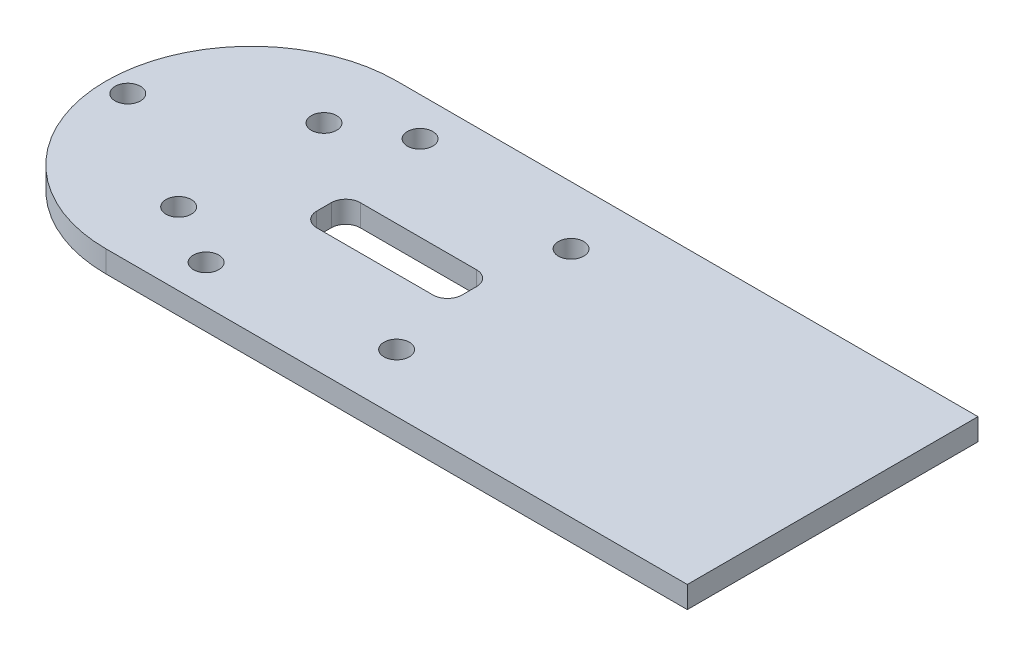
ISO-10303-21;
HEADER;
FILE_DESCRIPTION(('STEP AP214'),'2;1');
FILE_NAME('part.step','',(''),(''),'','','');
FILE_SCHEMA(('AUTOMOTIVE_DESIGN { 1 0 10303 214 1 1 1 1 }'));
ENDSEC;
DATA;
#1=APPLICATION_CONTEXT('core data for automotive mechanical design processes');
#2=APPLICATION_PROTOCOL_DEFINITION('international standard','automotive_design',2000,#1);
#3=PRODUCT_CONTEXT('',#1,'mechanical');
#4=PRODUCT('Part','Part','',(#3));
#5=PRODUCT_RELATED_PRODUCT_CATEGORY('part','',(#4));
#6=PRODUCT_DEFINITION_FORMATION('','',#4);
#7=PRODUCT_DEFINITION_CONTEXT('part definition',#1,'design');
#8=PRODUCT_DEFINITION('design','',#6,#7);
#9=PRODUCT_DEFINITION_SHAPE('','',#8);
#10=(LENGTH_UNIT() NAMED_UNIT(*) SI_UNIT(.MILLI.,.METRE.));
#11=(NAMED_UNIT(*) PLANE_ANGLE_UNIT() SI_UNIT($,.RADIAN.));
#12=(NAMED_UNIT(*) SI_UNIT($,.STERADIAN.) SOLID_ANGLE_UNIT());
#13=UNCERTAINTY_MEASURE_WITH_UNIT(LENGTH_MEASURE(1.E-05),#10,'distance_accuracy_value','');
#14=(GEOMETRIC_REPRESENTATION_CONTEXT(3) GLOBAL_UNCERTAINTY_ASSIGNED_CONTEXT((#13)) GLOBAL_UNIT_ASSIGNED_CONTEXT((#10,
#11,#12)) REPRESENTATION_CONTEXT('',''));
#15=CARTESIAN_POINT('',(0.,0.,0.));
#16=DIRECTION('',(0.,0.,1.));
#17=DIRECTION('',(1.,0.,0.));
#18=AXIS2_PLACEMENT_3D('',#15,#16,#17);
#19=CARTESIAN_POINT('',(50.,3.,20.));
#20=DIRECTION('',(-1.,0.,0.));
#21=DIRECTION('',(0.,0.,1.));
#22=AXIS2_PLACEMENT_3D('',#19,#20,#21);
#23=PLANE('',#22);
#24=DIRECTION('',(0.,0.,-1.));
#25=VECTOR('',#24,1.);
#26=CARTESIAN_POINT('',(50.,0.,20.));
#27=LINE('',#26,#25);
#28=CARTESIAN_POINT('',(50.,0.,20.));
#29=VERTEX_POINT('',#28);
#30=CARTESIAN_POINT('',(50.,0.,-20.));
#31=VERTEX_POINT('',#30);
#32=EDGE_CURVE('E146',#29,#31,#27,.T.);
#33=ORIENTED_EDGE('',*,*,#32,.T.);
#34=DIRECTION('',(0.,-1.,0.));
#35=VECTOR('',#34,1.);
#36=CARTESIAN_POINT('',(50.,3.,-20.));
#37=LINE('',#36,#35);
#38=CARTESIAN_POINT('',(50.,3.,-20.));
#39=VERTEX_POINT('',#38);
#40=EDGE_CURVE('E127',#39,#31,#37,.T.);
#41=ORIENTED_EDGE('',*,*,#40,.F.);
#42=DIRECTION('',(0.,0.,-1.));
#43=VECTOR('',#42,1.);
#44=CARTESIAN_POINT('',(50.,3.,20.));
#45=LINE('',#44,#43);
#46=CARTESIAN_POINT('',(50.,3.,20.));
#47=VERTEX_POINT('',#46);
#48=EDGE_CURVE('E134',#47,#39,#45,.T.);
#49=ORIENTED_EDGE('',*,*,#48,.F.);
#50=DIRECTION('',(0.,-1.,0.));
#51=VECTOR('',#50,1.);
#52=CARTESIAN_POINT('',(50.,3.,20.));
#53=LINE('',#52,#51);
#54=EDGE_CURVE('E236',#47,#29,#53,.T.);
#55=ORIENTED_EDGE('',*,*,#54,.T.);
#56=EDGE_LOOP('',(#33,#41,#49,#55));
#57=FACE_BOUND('',#56,.T.);
#58=ADVANCED_FACE('F33',(#57),#23,.F.);
#59=CARTESIAN_POINT('',(50.,3.,-20.));
#60=DIRECTION('',(0.,0.,1.));
#61=DIRECTION('',(1.,0.,0.));
#62=AXIS2_PLACEMENT_3D('',#59,#60,#61);
#63=PLANE('',#62);
#64=DIRECTION('',(-1.,0.,0.));
#65=VECTOR('',#64,1.);
#66=CARTESIAN_POINT('',(50.,0.,-20.));
#67=LINE('',#66,#65);
#68=CARTESIAN_POINT('',(-30.,0.,-20.));
#69=VERTEX_POINT('',#68);
#70=EDGE_CURVE('E238',#31,#69,#67,.T.);
#71=ORIENTED_EDGE('',*,*,#70,.T.);
#72=DIRECTION('',(0.,-1.,0.));
#73=VECTOR('',#72,1.);
#74=CARTESIAN_POINT('',(-30.,3.,-20.));
#75=LINE('',#74,#73);
#76=CARTESIAN_POINT('',(-30.,3.,-20.));
#77=VERTEX_POINT('',#76);
#78=EDGE_CURVE('E130',#77,#69,#75,.T.);
#79=ORIENTED_EDGE('',*,*,#78,.F.);
#80=DIRECTION('',(-1.,0.,0.));
#81=VECTOR('',#80,1.);
#82=CARTESIAN_POINT('',(50.,3.,-20.));
#83=LINE('',#82,#81);
#84=EDGE_CURVE('E123',#39,#77,#83,.T.);
#85=ORIENTED_EDGE('',*,*,#84,.F.);
#86=ORIENTED_EDGE('',*,*,#40,.T.);
#87=EDGE_LOOP('',(#71,#79,#85,#86));
#88=FACE_BOUND('',#87,.T.);
#89=ADVANCED_FACE('F125',(#88),#63,.F.);
#90=CARTESIAN_POINT('',(-30.,3.,0.));
#91=DIRECTION('',(0.,-1.,0.));
#92=DIRECTION('',(0.,0.,-1.));
#93=AXIS2_PLACEMENT_3D('',#90,#91,#92);
#94=CYLINDRICAL_SURFACE('',#93,20.);
#95=CARTESIAN_POINT('',(-30.,0.,0.));
#96=DIRECTION('',(0.,1.,0.));
#97=DIRECTION('',(0.,0.,1.));
#98=AXIS2_PLACEMENT_3D('',#95,#96,#97);
#99=CIRCLE('',#98,20.);
#100=CARTESIAN_POINT('',(-30.,0.,20.));
#101=VERTEX_POINT('',#100);
#102=EDGE_CURVE('E240',#69,#101,#99,.T.);
#103=ORIENTED_EDGE('',*,*,#102,.T.);
#104=DIRECTION('',(0.,-1.,0.));
#105=VECTOR('',#104,1.);
#106=CARTESIAN_POINT('',(-30.,3.,20.));
#107=LINE('',#106,#105);
#108=CARTESIAN_POINT('',(-30.,3.,20.));
#109=VERTEX_POINT('',#108);
#110=EDGE_CURVE('E151',#109,#101,#107,.T.);
#111=ORIENTED_EDGE('',*,*,#110,.F.);
#112=CARTESIAN_POINT('',(-30.,3.,0.));
#113=DIRECTION('',(0.,1.,0.));
#114=DIRECTION('',(0.,0.,1.));
#115=AXIS2_PLACEMENT_3D('',#112,#113,#114);
#116=CIRCLE('',#115,20.);
#117=EDGE_CURVE('E133',#77,#109,#116,.T.);
#118=ORIENTED_EDGE('',*,*,#117,.F.);
#119=ORIENTED_EDGE('',*,*,#78,.T.);
#120=EDGE_LOOP('',(#103,#111,#118,#119));
#121=FACE_BOUND('',#120,.T.);
#122=ADVANCED_FACE('F251',(#121),#94,.T.);
#123=CARTESIAN_POINT('',(50.,3.,20.));
#124=DIRECTION('',(0.,0.,-1.));
#125=DIRECTION('',(-1.,0.,0.));
#126=AXIS2_PLACEMENT_3D('',#123,#124,#125);
#127=PLANE('',#126);
#128=DIRECTION('',(1.,0.,0.));
#129=VECTOR('',#128,1.);
#130=CARTESIAN_POINT('',(50.,0.,20.));
#131=LINE('',#130,#129);
#132=EDGE_CURVE('E143',#101,#29,#131,.T.);
#133=ORIENTED_EDGE('',*,*,#132,.T.);
#134=ORIENTED_EDGE('',*,*,#54,.F.);
#135=DIRECTION('',(1.,0.,0.));
#136=VECTOR('',#135,1.);
#137=CARTESIAN_POINT('',(50.,3.,20.));
#138=LINE('',#137,#136);
#139=EDGE_CURVE('E139',#109,#47,#138,.T.);
#140=ORIENTED_EDGE('',*,*,#139,.F.);
#141=ORIENTED_EDGE('',*,*,#110,.T.);
#142=EDGE_LOOP('',(#133,#134,#140,#141));
#143=FACE_BOUND('',#142,.T.);
#144=ADVANCED_FACE('F247',(#143),#127,.F.);
#145=CARTESIAN_POINT('',(-30.,3.,0.));
#146=DIRECTION('',(0.,1.,0.));
#147=DIRECTION('',(0.,0.,1.));
#148=AXIS2_PLACEMENT_3D('',#145,#146,#147);
#149=PLANE('',#148);
#150=CARTESIAN_POINT('',(2.,3.,-12.));
#151=DIRECTION('',(0.,1.,0.));
#152=DIRECTION('',(0.,0.,1.));
#153=AXIS2_PLACEMENT_3D('',#150,#151,#152);
#154=CIRCLE('',#153,1.75);
#155=CARTESIAN_POINT('',(2.,3.,-10.25));
#156=VERTEX_POINT('',#155);
#157=EDGE_CURVE('E351',#156,#156,#154,.F.);
#158=ORIENTED_EDGE('',*,*,#157,.T.);
#159=EDGE_LOOP('',(#158));
#160=FACE_BOUND('',#159,.T.);
#161=CARTESIAN_POINT('',(2.,3.,12.));
#162=DIRECTION('',(0.,1.,0.));
#163=DIRECTION('',(0.,0.,1.));
#164=AXIS2_PLACEMENT_3D('',#161,#162,#163);
#165=CIRCLE('',#164,1.75);
#166=CARTESIAN_POINT('',(2.,3.,13.75));
#167=VERTEX_POINT('',#166);
#168=EDGE_CURVE('E347',#167,#167,#165,.F.);
#169=ORIENTED_EDGE('',*,*,#168,.T.);
#170=EDGE_LOOP('',(#169));
#171=FACE_BOUND('',#170,.T.);
#172=CARTESIAN_POINT('',(-47.,3.,0.));
#173=DIRECTION('',(0.,1.,0.));
#174=DIRECTION('',(0.,0.,1.));
#175=AXIS2_PLACEMENT_3D('',#172,#173,#174);
#176=CIRCLE('',#175,1.75);
#177=CARTESIAN_POINT('',(-47.,3.,1.75000000000001));
#178=VERTEX_POINT('',#177);
#179=EDGE_CURVE('E343',#178,#178,#176,.F.);
#180=ORIENTED_EDGE('',*,*,#179,.T.);
#181=EDGE_LOOP('',(#180));
#182=FACE_BOUND('',#181,.T.);
#183=CARTESIAN_POINT('',(-21.5,3.,14.7224318643355));
#184=DIRECTION('',(0.,1.,0.));
#185=DIRECTION('',(0.,0.,1.));
#186=AXIS2_PLACEMENT_3D('',#183,#184,#185);
#187=CIRCLE('',#186,1.75);
#188=CARTESIAN_POINT('',(-21.5,3.,16.4724318643355));
#189=VERTEX_POINT('',#188);
#190=EDGE_CURVE('E339',#189,#189,#187,.F.);
#191=ORIENTED_EDGE('',*,*,#190,.T.);
#192=EDGE_LOOP('',(#191));
#193=FACE_BOUND('',#192,.T.);
#194=CARTESIAN_POINT('',(-21.5,3.,-14.7224318643355));
#195=DIRECTION('',(0.,1.,0.));
#196=DIRECTION('',(0.,0.,1.));
#197=AXIS2_PLACEMENT_3D('',#194,#195,#196);
#198=CIRCLE('',#197,1.75000000000001);
#199=CARTESIAN_POINT('',(-21.5,3.,-12.9724318643355));
#200=VERTEX_POINT('',#199);
#201=EDGE_CURVE('E335',#200,#200,#198,.F.);
#202=ORIENTED_EDGE('',*,*,#201,.T.);
#203=EDGE_LOOP('',(#202));
#204=FACE_BOUND('',#203,.T.);
#205=DIRECTION('',(-1.,0.,0.));
#206=VECTOR('',#205,1.);
#207=CARTESIAN_POINT('',(0.,3.,3.00000000000001));
#208=LINE('',#207,#206);
#209=CARTESIAN_POINT('',(-2.00000000000001,3.,3.00000000000001));
#210=VERTEX_POINT('',#209);
#211=CARTESIAN_POINT('',(-18.,3.,3.00000000000001));
#212=VERTEX_POINT('',#211);
#213=EDGE_CURVE('E200',#210,#212,#208,.T.);
#214=ORIENTED_EDGE('',*,*,#213,.T.);
#215=CARTESIAN_POINT('',(-18.,3.,1.00000000000001));
#216=DIRECTION('',(0.,1.,0.));
#217=DIRECTION('',(0.,0.,1.));
#218=AXIS2_PLACEMENT_3D('',#215,#216,#217);
#219=CIRCLE('',#218,2.);
#220=CARTESIAN_POINT('',(-20.,3.,1.00000000000001));
#221=VERTEX_POINT('',#220);
#222=EDGE_CURVE('E177',#212,#221,#219,.F.);
#223=ORIENTED_EDGE('',*,*,#222,.T.);
#224=DIRECTION('',(0.,0.,-1.));
#225=VECTOR('',#224,1.);
#226=CARTESIAN_POINT('',(-20.,3.,-2.99999999999999));
#227=LINE('',#226,#225);
#228=CARTESIAN_POINT('',(-20.,3.,-0.999999999999991));
#229=VERTEX_POINT('',#228);
#230=EDGE_CURVE('E206',#221,#229,#227,.T.);
#231=ORIENTED_EDGE('',*,*,#230,.T.);
#232=CARTESIAN_POINT('',(-18.,3.,-0.999999999999991));
#233=DIRECTION('',(0.,1.,0.));
#234=DIRECTION('',(0.,0.,1.));
#235=AXIS2_PLACEMENT_3D('',#232,#233,#234);
#236=CIRCLE('',#235,2.);
#237=CARTESIAN_POINT('',(-18.,3.,-2.99999999999999));
#238=VERTEX_POINT('',#237);
#239=EDGE_CURVE('E173',#229,#238,#236,.F.);
#240=ORIENTED_EDGE('',*,*,#239,.T.);
#241=DIRECTION('',(1.,0.,0.));
#242=VECTOR('',#241,1.);
#243=CARTESIAN_POINT('',(0.,3.,-2.99999999999999));
#244=LINE('',#243,#242);
#245=CARTESIAN_POINT('',(-2.00000000000001,3.,-2.99999999999999));
#246=VERTEX_POINT('',#245);
#247=EDGE_CURVE('E220',#238,#246,#244,.T.);
#248=ORIENTED_EDGE('',*,*,#247,.T.);
#249=CARTESIAN_POINT('',(-2.00000000000001,3.,-0.999999999999989));
#250=DIRECTION('',(0.,1.,0.));
#251=DIRECTION('',(0.,0.,1.));
#252=AXIS2_PLACEMENT_3D('',#249,#250,#251);
#253=CIRCLE('',#252,2.);
#254=CARTESIAN_POINT('',(0.,3.,-0.999999999999989));
#255=VERTEX_POINT('',#254);
#256=EDGE_CURVE('E55',#246,#255,#253,.F.);
#257=ORIENTED_EDGE('',*,*,#256,.T.);
#258=DIRECTION('',(0.,0.,1.));
#259=VECTOR('',#258,1.);
#260=CARTESIAN_POINT('',(0.,3.,-2.99999999999999));
#261=LINE('',#260,#259);
#262=CARTESIAN_POINT('',(0.,3.,1.00000000000001));
#263=VERTEX_POINT('',#262);
#264=EDGE_CURVE('E202',#255,#263,#261,.T.);
#265=ORIENTED_EDGE('',*,*,#264,.T.);
#266=CARTESIAN_POINT('',(-2.00000000000001,3.,1.00000000000001));
#267=DIRECTION('',(0.,1.,0.));
#268=DIRECTION('',(0.,0.,1.));
#269=AXIS2_PLACEMENT_3D('',#266,#267,#268);
#270=CIRCLE('',#269,2.);
#271=EDGE_CURVE('E11',#263,#210,#270,.F.);
#272=ORIENTED_EDGE('',*,*,#271,.T.);
#273=EDGE_LOOP('',(#214,#223,#231,#240,#248,#257,#265,#272));
#274=FACE_BOUND('',#273,.T.);
#275=CARTESIAN_POINT('',(-30.,3.,10.));
#276=DIRECTION('',(0.,1.,0.));
#277=DIRECTION('',(0.,0.,1.));
#278=AXIS2_PLACEMENT_3D('',#275,#276,#277);
#279=CIRCLE('',#278,1.75);
#280=CARTESIAN_POINT('',(-30.,3.,11.75));
#281=VERTEX_POINT('',#280);
#282=EDGE_CURVE('E222',#281,#281,#279,.T.);
#283=ORIENTED_EDGE('',*,*,#282,.F.);
#284=EDGE_LOOP('',(#283));
#285=FACE_BOUND('',#284,.T.);
#286=CARTESIAN_POINT('',(-30.,3.,-9.99999999999999));
#287=DIRECTION('',(0.,1.,0.));
#288=DIRECTION('',(0.,0.,1.));
#289=AXIS2_PLACEMENT_3D('',#286,#287,#288);
#290=CIRCLE('',#289,1.75);
#291=CARTESIAN_POINT('',(-30.,3.,-8.24999999999999));
#292=VERTEX_POINT('',#291);
#293=EDGE_CURVE('E226',#292,#292,#290,.T.);
#294=ORIENTED_EDGE('',*,*,#293,.F.);
#295=EDGE_LOOP('',(#294));
#296=FACE_BOUND('',#295,.T.);
#297=ORIENTED_EDGE('',*,*,#48,.T.);
#298=ORIENTED_EDGE('',*,*,#84,.T.);
#299=ORIENTED_EDGE('',*,*,#117,.T.);
#300=ORIENTED_EDGE('',*,*,#139,.T.);
#301=EDGE_LOOP('',(#297,#298,#299,#300));
#302=FACE_BOUND('',#301,.T.);
#303=ADVANCED_FACE('F137',(#160,#171,#182,#193,#204,#274,#285,#296,#302),#149,.T.);
#304=CARTESIAN_POINT('',(-30.,0.,0.));
#305=DIRECTION('',(0.,1.,0.));
#306=DIRECTION('',(0.,0.,1.));
#307=AXIS2_PLACEMENT_3D('',#304,#305,#306);
#308=PLANE('',#307);
#309=CARTESIAN_POINT('',(2.,0.,-12.));
#310=DIRECTION('',(0.,-1.,0.));
#311=DIRECTION('',(0.,0.,-1.));
#312=AXIS2_PLACEMENT_3D('',#309,#310,#311);
#313=CIRCLE('',#312,1.75);
#314=CARTESIAN_POINT('',(2.,0.,-13.75));
#315=VERTEX_POINT('',#314);
#316=EDGE_CURVE('E319',#315,#315,#313,.T.);
#317=ORIENTED_EDGE('',*,*,#316,.F.);
#318=EDGE_LOOP('',(#317));
#319=FACE_BOUND('',#318,.T.);
#320=CARTESIAN_POINT('',(2.,0.,12.));
#321=DIRECTION('',(0.,-1.,0.));
#322=DIRECTION('',(0.,0.,-1.));
#323=AXIS2_PLACEMENT_3D('',#320,#321,#322);
#324=CIRCLE('',#323,1.75);
#325=CARTESIAN_POINT('',(2.,0.,10.25));
#326=VERTEX_POINT('',#325);
#327=EDGE_CURVE('E323',#326,#326,#324,.T.);
#328=ORIENTED_EDGE('',*,*,#327,.F.);
#329=EDGE_LOOP('',(#328));
#330=FACE_BOUND('',#329,.T.);
#331=CARTESIAN_POINT('',(-47.,0.,0.));
#332=DIRECTION('',(0.,-1.,0.));
#333=DIRECTION('',(0.,0.,-1.));
#334=AXIS2_PLACEMENT_3D('',#331,#332,#333);
#335=CIRCLE('',#334,1.75);
#336=CARTESIAN_POINT('',(-47.,0.,-1.74999999999999));
#337=VERTEX_POINT('',#336);
#338=EDGE_CURVE('E327',#337,#337,#335,.T.);
#339=ORIENTED_EDGE('',*,*,#338,.F.);
#340=EDGE_LOOP('',(#339));
#341=FACE_BOUND('',#340,.T.);
#342=CARTESIAN_POINT('',(-21.5,0.,14.7224318643355));
#343=DIRECTION('',(0.,-1.,0.));
#344=DIRECTION('',(0.,0.,-1.));
#345=AXIS2_PLACEMENT_3D('',#342,#343,#344);
#346=CIRCLE('',#345,1.75);
#347=CARTESIAN_POINT('',(-21.5,0.,12.9724318643355));
#348=VERTEX_POINT('',#347);
#349=EDGE_CURVE('E331',#348,#348,#346,.T.);
#350=ORIENTED_EDGE('',*,*,#349,.F.);
#351=EDGE_LOOP('',(#350));
#352=FACE_BOUND('',#351,.T.);
#353=CARTESIAN_POINT('',(-21.5,0.,-14.7224318643355));
#354=DIRECTION('',(0.,-1.,0.));
#355=DIRECTION('',(0.,0.,-1.));
#356=AXIS2_PLACEMENT_3D('',#353,#354,#355);
#357=CIRCLE('',#356,1.75000000000001);
#358=CARTESIAN_POINT('',(-21.5,0.,-16.4724318643355));
#359=VERTEX_POINT('',#358);
#360=EDGE_CURVE('E211',#359,#359,#357,.T.);
#361=ORIENTED_EDGE('',*,*,#360,.F.);
#362=EDGE_LOOP('',(#361));
#363=FACE_BOUND('',#362,.T.);
#364=DIRECTION('',(1.,0.,0.));
#365=VECTOR('',#364,1.);
#366=CARTESIAN_POINT('',(0.,0.,-2.99999999999999));
#367=LINE('',#366,#365);
#368=CARTESIAN_POINT('',(-18.,0.,-2.99999999999999));
#369=VERTEX_POINT('',#368);
#370=CARTESIAN_POINT('',(-2.00000000000001,0.,-2.99999999999999));
#371=VERTEX_POINT('',#370);
#372=EDGE_CURVE('E194',#369,#371,#367,.T.);
#373=ORIENTED_EDGE('',*,*,#372,.F.);
#374=CARTESIAN_POINT('',(-18.,0.,-0.999999999999991));
#375=DIRECTION('',(0.,1.,0.));
#376=DIRECTION('',(0.,0.,1.));
#377=AXIS2_PLACEMENT_3D('',#374,#375,#376);
#378=CIRCLE('',#377,2.);
#379=CARTESIAN_POINT('',(-20.,0.,-0.999999999999991));
#380=VERTEX_POINT('',#379);
#381=EDGE_CURVE('E171',#369,#380,#378,.T.);
#382=ORIENTED_EDGE('',*,*,#381,.T.);
#383=DIRECTION('',(0.,0.,-1.));
#384=VECTOR('',#383,1.);
#385=CARTESIAN_POINT('',(-20.,0.,-2.99999999999999));
#386=LINE('',#385,#384);
#387=CARTESIAN_POINT('',(-20.,0.,1.00000000000001));
#388=VERTEX_POINT('',#387);
#389=EDGE_CURVE('E209',#388,#380,#386,.T.);
#390=ORIENTED_EDGE('',*,*,#389,.F.);
#391=CARTESIAN_POINT('',(-18.,0.,1.00000000000001));
#392=DIRECTION('',(0.,1.,0.));
#393=DIRECTION('',(0.,0.,1.));
#394=AXIS2_PLACEMENT_3D('',#391,#392,#393);
#395=CIRCLE('',#394,2.);
#396=CARTESIAN_POINT('',(-18.,0.,3.00000000000001));
#397=VERTEX_POINT('',#396);
#398=EDGE_CURVE('E175',#388,#397,#395,.T.);
#399=ORIENTED_EDGE('',*,*,#398,.T.);
#400=DIRECTION('',(-1.,0.,0.));
#401=VECTOR('',#400,1.);
#402=CARTESIAN_POINT('',(0.,0.,3.00000000000001));
#403=LINE('',#402,#401);
#404=CARTESIAN_POINT('',(-2.00000000000001,0.,3.00000000000001));
#405=VERTEX_POINT('',#404);
#406=EDGE_CURVE('E189',#405,#397,#403,.T.);
#407=ORIENTED_EDGE('',*,*,#406,.F.);
#408=CARTESIAN_POINT('',(-2.00000000000001,0.,1.00000000000001));
#409=DIRECTION('',(0.,1.,0.));
#410=DIRECTION('',(0.,0.,1.));
#411=AXIS2_PLACEMENT_3D('',#408,#409,#410);
#412=CIRCLE('',#411,2.);
#413=CARTESIAN_POINT('',(0.,0.,1.00000000000001));
#414=VERTEX_POINT('',#413);
#415=EDGE_CURVE('E41',#405,#414,#412,.T.);
#416=ORIENTED_EDGE('',*,*,#415,.T.);
#417=DIRECTION('',(0.,0.,1.));
#418=VECTOR('',#417,1.);
#419=CARTESIAN_POINT('',(0.,0.,-2.99999999999999));
#420=LINE('',#419,#418);
#421=CARTESIAN_POINT('',(0.,0.,-0.999999999999989));
#422=VERTEX_POINT('',#421);
#423=EDGE_CURVE('E187',#422,#414,#420,.T.);
#424=ORIENTED_EDGE('',*,*,#423,.F.);
#425=CARTESIAN_POINT('',(-2.00000000000001,0.,-0.999999999999989));
#426=DIRECTION('',(0.,1.,0.));
#427=DIRECTION('',(0.,0.,1.));
#428=AXIS2_PLACEMENT_3D('',#425,#426,#427);
#429=CIRCLE('',#428,2.);
#430=EDGE_CURVE('E179',#422,#371,#429,.T.);
#431=ORIENTED_EDGE('',*,*,#430,.T.);
#432=EDGE_LOOP('',(#373,#382,#390,#399,#407,#416,#424,#431));
#433=FACE_BOUND('',#432,.T.);
#434=CARTESIAN_POINT('',(-30.,0.,10.));
#435=DIRECTION('',(0.,1.,0.));
#436=DIRECTION('',(0.,0.,1.));
#437=AXIS2_PLACEMENT_3D('',#434,#435,#436);
#438=CIRCLE('',#437,1.75);
#439=CARTESIAN_POINT('',(-30.,0.,11.75));
#440=VERTEX_POINT('',#439);
#441=EDGE_CURVE('E223',#440,#440,#438,.T.);
#442=ORIENTED_EDGE('',*,*,#441,.T.);
#443=EDGE_LOOP('',(#442));
#444=FACE_BOUND('',#443,.T.);
#445=CARTESIAN_POINT('',(-30.,0.,-9.99999999999999));
#446=DIRECTION('',(0.,1.,0.));
#447=DIRECTION('',(0.,0.,1.));
#448=AXIS2_PLACEMENT_3D('',#445,#446,#447);
#449=CIRCLE('',#448,1.75);
#450=CARTESIAN_POINT('',(-30.,0.,-8.24999999999999));
#451=VERTEX_POINT('',#450);
#452=EDGE_CURVE('E229',#451,#451,#449,.T.);
#453=ORIENTED_EDGE('',*,*,#452,.T.);
#454=EDGE_LOOP('',(#453));
#455=FACE_BOUND('',#454,.T.);
#456=ORIENTED_EDGE('',*,*,#32,.F.);
#457=ORIENTED_EDGE('',*,*,#132,.F.);
#458=ORIENTED_EDGE('',*,*,#102,.F.);
#459=ORIENTED_EDGE('',*,*,#70,.F.);
#460=EDGE_LOOP('',(#456,#457,#458,#459));
#461=FACE_BOUND('',#460,.T.);
#462=ADVANCED_FACE('F185',(#319,#330,#341,#352,#363,#433,#444,#455,#461),#308,.F.);
#463=CARTESIAN_POINT('',(-30.,0.,-9.99999999999999));
#464=DIRECTION('',(0.,1.,0.));
#465=DIRECTION('',(0.,0.,1.));
#466=AXIS2_PLACEMENT_3D('',#463,#464,#465);
#467=CYLINDRICAL_SURFACE('',#466,1.75);
#468=ORIENTED_EDGE('',*,*,#452,.F.);
#469=EDGE_LOOP('',(#468));
#470=FACE_BOUND('',#469,.T.);
#471=ORIENTED_EDGE('',*,*,#293,.T.);
#472=EDGE_LOOP('',(#471));
#473=FACE_BOUND('',#472,.T.);
#474=ADVANCED_FACE('F299',(#470,#473),#467,.F.);
#475=CARTESIAN_POINT('',(-30.,0.,10.));
#476=DIRECTION('',(0.,1.,0.));
#477=DIRECTION('',(0.,0.,1.));
#478=AXIS2_PLACEMENT_3D('',#475,#476,#477);
#479=CYLINDRICAL_SURFACE('',#478,1.75);
#480=ORIENTED_EDGE('',*,*,#441,.F.);
#481=EDGE_LOOP('',(#480));
#482=FACE_BOUND('',#481,.T.);
#483=ORIENTED_EDGE('',*,*,#282,.T.);
#484=EDGE_LOOP('',(#483));
#485=FACE_BOUND('',#484,.T.);
#486=ADVANCED_FACE('F292',(#482,#485),#479,.F.);
#487=CARTESIAN_POINT('',(-20.,3.001,-2.99999999999999));
#488=DIRECTION('',(-1.,0.,0.));
#489=DIRECTION('',(0.,0.,1.));
#490=AXIS2_PLACEMENT_3D('',#487,#488,#489);
#491=PLANE('',#490);
#492=ORIENTED_EDGE('',*,*,#389,.T.);
#493=DIRECTION('',(0.,-1.,0.));
#494=VECTOR('',#493,1.);
#495=CARTESIAN_POINT('',(-20.,3.,-0.999999999999991));
#496=LINE('',#495,#494);
#497=EDGE_CURVE('E160',#380,#229,#496,.F.);
#498=ORIENTED_EDGE('',*,*,#497,.T.);
#499=ORIENTED_EDGE('',*,*,#230,.F.);
#500=DIRECTION('',(0.,-1.,0.));
#501=VECTOR('',#500,1.);
#502=CARTESIAN_POINT('',(-20.,0.,1.00000000000001));
#503=LINE('',#502,#501);
#504=EDGE_CURVE('E157',#221,#388,#503,.T.);
#505=ORIENTED_EDGE('',*,*,#504,.T.);
#506=EDGE_LOOP('',(#492,#498,#499,#505));
#507=FACE_BOUND('',#506,.T.);
#508=ADVANCED_FACE('F288',(#507),#491,.F.);
#509=CARTESIAN_POINT('',(0.,3.001,3.00000000000001));
#510=DIRECTION('',(0.,0.,1.));
#511=DIRECTION('',(1.,0.,0.));
#512=AXIS2_PLACEMENT_3D('',#509,#510,#511);
#513=PLANE('',#512);
#514=ORIENTED_EDGE('',*,*,#406,.T.);
#515=DIRECTION('',(0.,-1.,0.));
#516=VECTOR('',#515,1.);
#517=CARTESIAN_POINT('',(-18.,3.,3.00000000000001));
#518=LINE('',#517,#516);
#519=EDGE_CURVE('E165',#397,#212,#518,.F.);
#520=ORIENTED_EDGE('',*,*,#519,.T.);
#521=ORIENTED_EDGE('',*,*,#213,.F.);
#522=DIRECTION('',(0.,-1.,0.));
#523=VECTOR('',#522,1.);
#524=CARTESIAN_POINT('',(-2.00000000000001,0.,3.00000000000001));
#525=LINE('',#524,#523);
#526=EDGE_CURVE('E162',#210,#405,#525,.T.);
#527=ORIENTED_EDGE('',*,*,#526,.T.);
#528=EDGE_LOOP('',(#514,#520,#521,#527));
#529=FACE_BOUND('',#528,.T.);
#530=ADVANCED_FACE('F204',(#529),#513,.F.);
#531=CARTESIAN_POINT('',(0.,3.001,-2.99999999999999));
#532=DIRECTION('',(1.,0.,0.));
#533=DIRECTION('',(0.,0.,-1.));
#534=AXIS2_PLACEMENT_3D('',#531,#532,#533);
#535=PLANE('',#534);
#536=ORIENTED_EDGE('',*,*,#264,.F.);
#537=DIRECTION('',(0.,-1.,0.));
#538=VECTOR('',#537,1.);
#539=CARTESIAN_POINT('',(0.,0.,-0.999999999999989));
#540=LINE('',#539,#538);
#541=EDGE_CURVE('E168',#255,#422,#540,.T.);
#542=ORIENTED_EDGE('',*,*,#541,.T.);
#543=ORIENTED_EDGE('',*,*,#423,.T.);
#544=DIRECTION('',(0.,-1.,0.));
#545=VECTOR('',#544,1.);
#546=CARTESIAN_POINT('',(0.,3.,1.00000000000001));
#547=LINE('',#546,#545);
#548=EDGE_CURVE('E48',#414,#263,#547,.F.);
#549=ORIENTED_EDGE('',*,*,#548,.T.);
#550=EDGE_LOOP('',(#536,#542,#543,#549));
#551=FACE_BOUND('',#550,.T.);
#552=ADVANCED_FACE('F192',(#551),#535,.F.);
#553=CARTESIAN_POINT('',(0.,3.001,-2.99999999999999));
#554=DIRECTION('',(0.,0.,-1.));
#555=DIRECTION('',(-1.,0.,0.));
#556=AXIS2_PLACEMENT_3D('',#553,#554,#555);
#557=PLANE('',#556);
#558=ORIENTED_EDGE('',*,*,#247,.F.);
#559=DIRECTION('',(0.,-1.,0.));
#560=VECTOR('',#559,1.);
#561=CARTESIAN_POINT('',(-18.,0.,-2.99999999999999));
#562=LINE('',#561,#560);
#563=EDGE_CURVE('E149',#238,#369,#562,.T.);
#564=ORIENTED_EDGE('',*,*,#563,.T.);
#565=ORIENTED_EDGE('',*,*,#372,.T.);
#566=DIRECTION('',(0.,-1.,0.));
#567=VECTOR('',#566,1.);
#568=CARTESIAN_POINT('',(-2.00000000000001,3.,-2.99999999999999));
#569=LINE('',#568,#567);
#570=EDGE_CURVE('E147',#371,#246,#569,.F.);
#571=ORIENTED_EDGE('',*,*,#570,.T.);
#572=EDGE_LOOP('',(#558,#564,#565,#571));
#573=FACE_BOUND('',#572,.T.);
#574=ADVANCED_FACE('F269',(#573),#557,.F.);
#575=CARTESIAN_POINT('',(-18.,3.001,-0.999999999999991));
#576=DIRECTION('',(0.,1.,0.));
#577=DIRECTION('',(0.,0.,1.));
#578=AXIS2_PLACEMENT_3D('',#575,#576,#577);
#579=CYLINDRICAL_SURFACE('',#578,2.);
#580=ORIENTED_EDGE('',*,*,#239,.F.);
#581=ORIENTED_EDGE('',*,*,#497,.F.);
#582=ORIENTED_EDGE('',*,*,#381,.F.);
#583=ORIENTED_EDGE('',*,*,#563,.F.);
#584=EDGE_LOOP('',(#580,#581,#582,#583));
#585=FACE_BOUND('',#584,.T.);
#586=ADVANCED_FACE('F265',(#585),#579,.F.);
#587=CARTESIAN_POINT('',(-18.,3.001,1.00000000000001));
#588=DIRECTION('',(0.,1.,0.));
#589=DIRECTION('',(0.,0.,1.));
#590=AXIS2_PLACEMENT_3D('',#587,#588,#589);
#591=CYLINDRICAL_SURFACE('',#590,2.);
#592=ORIENTED_EDGE('',*,*,#222,.F.);
#593=ORIENTED_EDGE('',*,*,#519,.F.);
#594=ORIENTED_EDGE('',*,*,#398,.F.);
#595=ORIENTED_EDGE('',*,*,#504,.F.);
#596=EDGE_LOOP('',(#592,#593,#594,#595));
#597=FACE_BOUND('',#596,.T.);
#598=ADVANCED_FACE('F268',(#597),#591,.F.);
#599=CARTESIAN_POINT('',(-2.00000000000001,3.001,-0.999999999999989));
#600=DIRECTION('',(0.,1.,0.));
#601=DIRECTION('',(0.,0.,1.));
#602=AXIS2_PLACEMENT_3D('',#599,#600,#601);
#603=CYLINDRICAL_SURFACE('',#602,2.);
#604=ORIENTED_EDGE('',*,*,#256,.F.);
#605=ORIENTED_EDGE('',*,*,#570,.F.);
#606=ORIENTED_EDGE('',*,*,#430,.F.);
#607=ORIENTED_EDGE('',*,*,#541,.F.);
#608=EDGE_LOOP('',(#604,#605,#606,#607));
#609=FACE_BOUND('',#608,.T.);
#610=ADVANCED_FACE('F272',(#609),#603,.F.);
#611=CARTESIAN_POINT('',(-2.00000000000001,3.001,1.00000000000001));
#612=DIRECTION('',(0.,1.,0.));
#613=DIRECTION('',(0.,0.,1.));
#614=AXIS2_PLACEMENT_3D('',#611,#612,#613);
#615=CYLINDRICAL_SURFACE('',#614,2.);
#616=ORIENTED_EDGE('',*,*,#271,.F.);
#617=ORIENTED_EDGE('',*,*,#548,.F.);
#618=ORIENTED_EDGE('',*,*,#415,.F.);
#619=ORIENTED_EDGE('',*,*,#526,.F.);
#620=EDGE_LOOP('',(#616,#617,#618,#619));
#621=FACE_BOUND('',#620,.T.);
#622=ADVANCED_FACE('F35',(#621),#615,.F.);
#623=CARTESIAN_POINT('',(-21.5,3.001,-14.7224318643355));
#624=DIRECTION('',(0.,-1.,0.));
#625=DIRECTION('',(0.,0.,-1.));
#626=AXIS2_PLACEMENT_3D('',#623,#624,#625);
#627=CYLINDRICAL_SURFACE('',#626,1.75000000000001);
#628=ORIENTED_EDGE('',*,*,#201,.F.);
#629=EDGE_LOOP('',(#628));
#630=FACE_BOUND('',#629,.T.);
#631=ORIENTED_EDGE('',*,*,#360,.T.);
#632=EDGE_LOOP('',(#631));
#633=FACE_BOUND('',#632,.T.);
#634=ADVANCED_FACE('F279',(#630,#633),#627,.F.);
#635=CARTESIAN_POINT('',(-21.5,3.001,14.7224318643355));
#636=DIRECTION('',(0.,-1.,0.));
#637=DIRECTION('',(0.,0.,-1.));
#638=AXIS2_PLACEMENT_3D('',#635,#636,#637);
#639=CYLINDRICAL_SURFACE('',#638,1.75);
#640=ORIENTED_EDGE('',*,*,#190,.F.);
#641=EDGE_LOOP('',(#640));
#642=FACE_BOUND('',#641,.T.);
#643=ORIENTED_EDGE('',*,*,#349,.T.);
#644=EDGE_LOOP('',(#643));
#645=FACE_BOUND('',#644,.T.);
#646=ADVANCED_FACE('F370',(#642,#645),#639,.F.);
#647=CARTESIAN_POINT('',(-47.,3.001,0.));
#648=DIRECTION('',(0.,-1.,0.));
#649=DIRECTION('',(0.,0.,-1.));
#650=AXIS2_PLACEMENT_3D('',#647,#648,#649);
#651=CYLINDRICAL_SURFACE('',#650,1.75);
#652=ORIENTED_EDGE('',*,*,#179,.F.);
#653=EDGE_LOOP('',(#652));
#654=FACE_BOUND('',#653,.T.);
#655=ORIENTED_EDGE('',*,*,#338,.T.);
#656=EDGE_LOOP('',(#655));
#657=FACE_BOUND('',#656,.T.);
#658=ADVANCED_FACE('F363',(#654,#657),#651,.F.);
#659=CARTESIAN_POINT('',(2.,3.001,12.));
#660=DIRECTION('',(0.,-1.,0.));
#661=DIRECTION('',(0.,0.,-1.));
#662=AXIS2_PLACEMENT_3D('',#659,#660,#661);
#663=CYLINDRICAL_SURFACE('',#662,1.75);
#664=ORIENTED_EDGE('',*,*,#168,.F.);
#665=EDGE_LOOP('',(#664));
#666=FACE_BOUND('',#665,.T.);
#667=ORIENTED_EDGE('',*,*,#327,.T.);
#668=EDGE_LOOP('',(#667));
#669=FACE_BOUND('',#668,.T.);
#670=ADVANCED_FACE('F357',(#666,#669),#663,.F.);
#671=CARTESIAN_POINT('',(2.,3.001,-12.));
#672=DIRECTION('',(0.,-1.,0.));
#673=DIRECTION('',(0.,0.,-1.));
#674=AXIS2_PLACEMENT_3D('',#671,#672,#673);
#675=CYLINDRICAL_SURFACE('',#674,1.75);
#676=ORIENTED_EDGE('',*,*,#157,.F.);
#677=EDGE_LOOP('',(#676));
#678=FACE_BOUND('',#677,.T.);
#679=ORIENTED_EDGE('',*,*,#316,.T.);
#680=EDGE_LOOP('',(#679));
#681=FACE_BOUND('',#680,.T.);
#682=ADVANCED_FACE('F355',(#678,#681),#675,.F.);
#683=CLOSED_SHELL('',(#58,#89,#122,#144,#303,#462,#474,#486,#508,#530,#552,#574,#586,#598,#610,
#622,#634,#646,#658,#670,#682));
#684=MANIFOLD_SOLID_BREP('B2',#683);
#685=ADVANCED_BREP_SHAPE_REPRESENTATION('',(#18,#684),#14);
#686=SHAPE_DEFINITION_REPRESENTATION(#9,#685);
ENDSEC;
END-ISO-10303-21;
